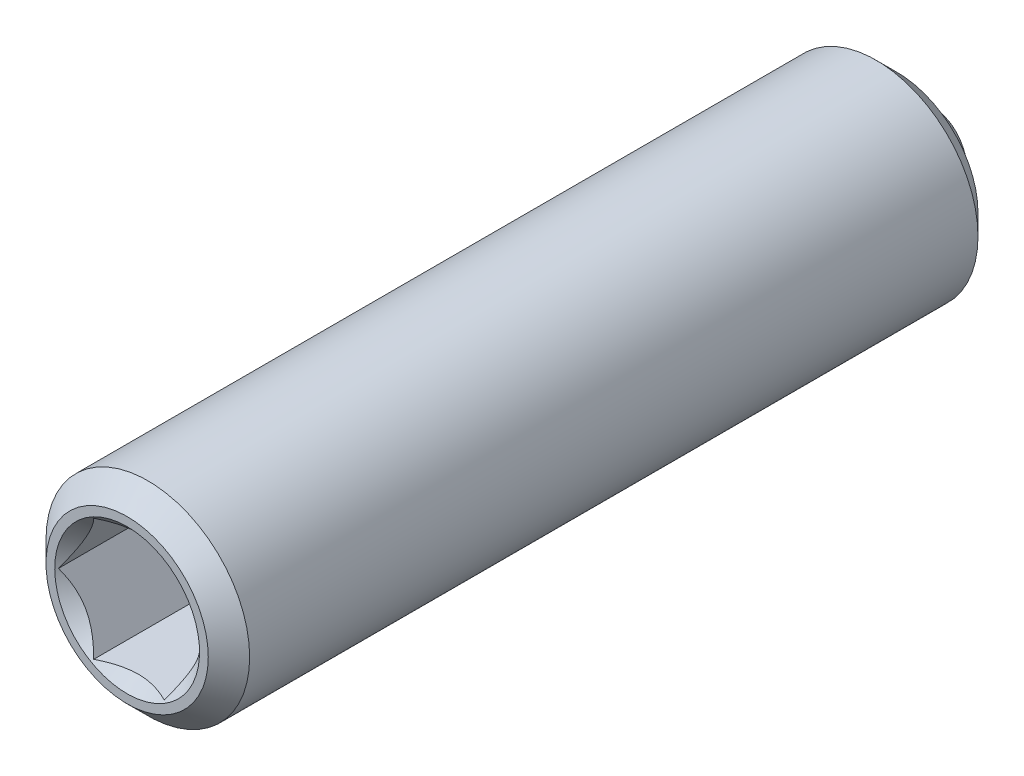
ISO-10303-21;
HEADER;
FILE_DESCRIPTION(('STEP AP214'),'2;1');
FILE_NAME('part.step','',(''),(''),'','','');
FILE_SCHEMA(('AUTOMOTIVE_DESIGN { 1 0 10303 214 1 1 1 1 }'));
ENDSEC;
DATA;
#1=APPLICATION_CONTEXT('core data for automotive mechanical design processes');
#2=APPLICATION_PROTOCOL_DEFINITION('international standard','automotive_design',2000,#1);
#3=PRODUCT_CONTEXT('',#1,'mechanical');
#4=PRODUCT('Part','Part','',(#3));
#5=PRODUCT_RELATED_PRODUCT_CATEGORY('part','',(#4));
#6=PRODUCT_DEFINITION_FORMATION('','',#4);
#7=PRODUCT_DEFINITION_CONTEXT('part definition',#1,'design');
#8=PRODUCT_DEFINITION('design','',#6,#7);
#9=PRODUCT_DEFINITION_SHAPE('','',#8);
#10=(LENGTH_UNIT() NAMED_UNIT(*) SI_UNIT(.MILLI.,.METRE.));
#11=(NAMED_UNIT(*) PLANE_ANGLE_UNIT() SI_UNIT($,.RADIAN.));
#12=(NAMED_UNIT(*) SI_UNIT($,.STERADIAN.) SOLID_ANGLE_UNIT());
#13=UNCERTAINTY_MEASURE_WITH_UNIT(LENGTH_MEASURE(1.E-05),#10,'distance_accuracy_value','');
#14=(GEOMETRIC_REPRESENTATION_CONTEXT(3) GLOBAL_UNCERTAINTY_ASSIGNED_CONTEXT((#13)) GLOBAL_UNIT_ASSIGNED_CONTEXT((#10,
#11,#12)) REPRESENTATION_CONTEXT('',''));
#15=CARTESIAN_POINT('',(0.,0.,0.));
#16=DIRECTION('',(0.,0.,1.));
#17=DIRECTION('',(1.,0.,0.));
#18=AXIS2_PLACEMENT_3D('',#15,#16,#17);
#19=CARTESIAN_POINT('',(-33.1630007981403,28.7089673374794,2.71961483447506));
#20=DIRECTION('',(0.,0.,-1.));
#21=DIRECTION('',(-1.,0.,0.));
#22=AXIS2_PLACEMENT_3D('',#19,#20,#21);
#23=PLANE('',#22);
#24=CARTESIAN_POINT('',(-33.1630007981403,28.7089673374794,2.71961483447507));
#25=DIRECTION('',(0.,0.,-1.));
#26=DIRECTION('',(0.,1.,0.));
#27=AXIS2_PLACEMENT_3D('',#24,#25,#26);
#28=CIRCLE('',#27,0.889);
#29=CARTESIAN_POINT('',(-33.1630007981403,29.5979673374794,2.71961483447507));
#30=VERTEX_POINT('',#29);
#31=EDGE_CURVE('P0_E164',#30,#30,#28,.T.);
#32=ORIENTED_EDGE('',*,*,#31,.T.);
#33=EDGE_LOOP('',(#32));
#34=FACE_BOUND('',#33,.T.);
#35=CARTESIAN_POINT('',(-33.1630007981403,28.7089673374794,2.71961483447507));
#36=DIRECTION('',(0.,0.,1.));
#37=DIRECTION('',(1.,0.,0.));
#38=AXIS2_PLACEMENT_3D('',#35,#36,#37);
#39=CIRCLE('',#38,0.996);
#40=CARTESIAN_POINT('',(-32.1670007981403,28.7089673374794,2.71961483447507));
#41=VERTEX_POINT('',#40);
#42=EDGE_CURVE('P0_E29',#41,#41,#39,.T.);
#43=ORIENTED_EDGE('',*,*,#42,.T.);
#44=EDGE_LOOP('',(#43));
#45=FACE_BOUND('',#44,.T.);
#46=ADVANCED_FACE('P0_F17',(#34,#45),#23,.F.);
#47=CARTESIAN_POINT('',(-33.1630007981403,28.7089673374794,2.46561483447506));
#48=DIRECTION('',(0.,0.,-1.));
#49=DIRECTION('',(-1.,0.,0.));
#50=AXIS2_PLACEMENT_3D('',#47,#48,#49);
#51=CONICAL_SURFACE('',#50,1.25,0.78539816339744);
#52=ORIENTED_EDGE('',*,*,#42,.F.);
#53=EDGE_LOOP('',(#52));
#54=FACE_BOUND('',#53,.T.);
#55=CARTESIAN_POINT('',(-33.1630007981403,28.7089673374794,2.46561483447506));
#56=DIRECTION('',(0.,0.,1.));
#57=DIRECTION('',(1.,0.,0.));
#58=AXIS2_PLACEMENT_3D('',#55,#56,#57);
#59=CIRCLE('',#58,1.25);
#60=CARTESIAN_POINT('',(-31.9130007981403,28.7089673374794,2.46561483447506));
#61=VERTEX_POINT('',#60);
#62=EDGE_CURVE('P0_E113',#61,#61,#59,.T.);
#63=ORIENTED_EDGE('',*,*,#62,.T.);
#64=EDGE_LOOP('',(#63));
#65=FACE_BOUND('',#64,.T.);
#66=ADVANCED_FACE('P0_F119',(#54,#65),#51,.T.);
#67=CARTESIAN_POINT('',(-33.1630007981403,28.7089673374794,57.6778825031788));
#68=DIRECTION('',(0.,0.,1.));
#69=DIRECTION('',(1.,0.,0.));
#70=AXIS2_PLACEMENT_3D('',#67,#68,#69);
#71=CYLINDRICAL_SURFACE('',#70,1.25);
#72=ORIENTED_EDGE('',*,*,#62,.F.);
#73=EDGE_LOOP('',(#72));
#74=FACE_BOUND('',#73,.T.);
#75=CARTESIAN_POINT('',(-33.1630007981403,28.7089673374794,-6.47518516552494));
#76=DIRECTION('',(0.,0.,1.));
#77=DIRECTION('',(1.,0.,0.));
#78=AXIS2_PLACEMENT_3D('',#75,#76,#77);
#79=CIRCLE('',#78,1.25);
#80=CARTESIAN_POINT('',(-31.9130007981403,28.7089673374794,-6.47518516552494));
#81=VERTEX_POINT('',#80);
#82=EDGE_CURVE('P0_E110',#81,#81,#79,.T.);
#83=ORIENTED_EDGE('',*,*,#82,.T.);
#84=EDGE_LOOP('',(#83));
#85=FACE_BOUND('',#84,.T.);
#86=ADVANCED_FACE('P0_F122',(#74,#85),#71,.T.);
#87=CARTESIAN_POINT('',(-33.1630007981403,28.7089673374794,-6.72918516552494));
#88=DIRECTION('',(0.,0.,1.));
#89=DIRECTION('',(1.,0.,0.));
#90=AXIS2_PLACEMENT_3D('',#87,#88,#89);
#91=CONICAL_SURFACE('',#90,0.996,0.78539816339744);
#92=ORIENTED_EDGE('',*,*,#82,.F.);
#93=EDGE_LOOP('',(#92));
#94=FACE_BOUND('',#93,.T.);
#95=CARTESIAN_POINT('',(-33.1630007981403,28.7089673374794,-6.72918516552494));
#96=DIRECTION('',(0.,0.,1.));
#97=DIRECTION('',(1.,0.,0.));
#98=AXIS2_PLACEMENT_3D('',#95,#96,#97);
#99=CIRCLE('',#98,0.996);
#100=CARTESIAN_POINT('',(-32.1670007981403,28.7089673374794,-6.72918516552494));
#101=VERTEX_POINT('',#100);
#102=EDGE_CURVE('P0_E107',#101,#101,#99,.T.);
#103=ORIENTED_EDGE('',*,*,#102,.T.);
#104=EDGE_LOOP('',(#103));
#105=FACE_BOUND('',#104,.T.);
#106=ADVANCED_FACE('P0_F127',(#94,#105),#91,.T.);
#107=CARTESIAN_POINT('',(-33.1630007981403,29.7049673374794,-6.72918516552494));
#108=DIRECTION('',(0.,0.,1.));
#109=DIRECTION('',(1.,0.,0.));
#110=AXIS2_PLACEMENT_3D('',#107,#108,#109);
#111=PLANE('',#110);
#112=ORIENTED_EDGE('',*,*,#102,.F.);
#113=EDGE_LOOP('',(#112));
#114=FACE_BOUND('',#113,.T.);
#115=CARTESIAN_POINT('',(-33.1630007981403,28.7089673374794,-6.72918516552494));
#116=DIRECTION('',(0.,0.,1.));
#117=DIRECTION('',(1.,0.,0.));
#118=AXIS2_PLACEMENT_3D('',#115,#116,#117);
#119=CIRCLE('',#118,0.75);
#120=CARTESIAN_POINT('',(-32.4130007981403,28.7089673374794,-6.72918516552494));
#121=VERTEX_POINT('',#120);
#122=EDGE_CURVE('P0_E104',#121,#121,#119,.T.);
#123=ORIENTED_EDGE('',*,*,#122,.T.);
#124=EDGE_LOOP('',(#123));
#125=FACE_BOUND('',#124,.T.);
#126=ADVANCED_FACE('P0_F133',(#114,#125),#111,.F.);
#127=CARTESIAN_POINT('',(-33.1630007981403,28.7089673374794,57.6778825031788));
#128=DIRECTION('',(0.,0.,1.));
#129=DIRECTION('',(1.,0.,0.));
#130=AXIS2_PLACEMENT_3D('',#127,#128,#129);
#131=CYLINDRICAL_SURFACE('',#130,0.75);
#132=ORIENTED_EDGE('',*,*,#122,.F.);
#133=EDGE_LOOP('',(#132));
#134=FACE_BOUND('',#133,.T.);
#135=CARTESIAN_POINT('',(-33.1630007981403,28.7089673374794,-6.22732499374512));
#136=DIRECTION('',(0.,0.,1.));
#137=DIRECTION('',(1.,0.,0.));
#138=AXIS2_PLACEMENT_3D('',#135,#136,#137);
#139=CIRCLE('',#138,0.75);
#140=CARTESIAN_POINT('',(-32.4130007981403,28.7089673374794,-6.22732499374512));
#141=VERTEX_POINT('',#140);
#142=EDGE_CURVE('P0_E101',#141,#141,#139,.T.);
#143=ORIENTED_EDGE('',*,*,#142,.T.);
#144=EDGE_LOOP('',(#143));
#145=FACE_BOUND('',#144,.T.);
#146=ADVANCED_FACE('P0_F139',(#134,#145),#131,.F.);
#147=CARTESIAN_POINT('',(-33.1630007981403,28.7089673374794,-5.47732499374511));
#148=DIRECTION('',(0.,0.,-1.));
#149=DIRECTION('',(-1.,0.,0.));
#150=AXIS2_PLACEMENT_3D('',#147,#148,#149);
#151=CONICAL_SURFACE('',#150,0.,0.785398163397435);
#152=ORIENTED_EDGE('',*,*,#142,.F.);
#153=EDGE_LOOP('',(#152));
#154=FACE_BOUND('',#153,.T.);
#155=CARTESIAN_POINT('',(-33.1630007981403,28.7089673374794,-5.47732499374511));
#156=VERTEX_POINT('',#155);
#157=VERTEX_LOOP('',#156);
#158=FACE_BOUND('',#157,.T.);
#159=ADVANCED_FACE('P0_F145',(#154,#158),#151,.F.);
#160=CARTESIAN_POINT('',(-33.1630007981403,28.7089673374794,1.83061483447508));
#161=DIRECTION('',(0.,0.,1.));
#162=DIRECTION('',(0.,-1.,0.));
#163=AXIS2_PLACEMENT_3D('',#160,#161,#162);
#164=CONICAL_SURFACE('',#163,0.,0.785398163397453);
#165=ORIENTED_EDGE('',*,*,#31,.F.);
#166=EDGE_LOOP('',(#165));
#167=FACE_BOUND('',#166,.T.);
#168=CARTESIAN_POINT('',(-34.0425134321986,27.9589673374794,2.98648786966026));
#169=CARTESIAN_POINT('',(-34.0211681100344,27.9589673374794,2.97024847947383));
#170=CARTESIAN_POINT('',(-33.9997055705422,27.9589673374794,2.95416358783385));
#171=CARTESIAN_POINT('',(-33.9564979950275,27.9589673374794,2.92236706739637));
#172=CARTESIAN_POINT('',(-33.9347528915436,27.9589673374794,2.90665553036631));
#173=CARTESIAN_POINT('',(-33.8687032144859,27.9589673374794,2.85995296646633));
#174=CARTESIAN_POINT('',(-33.8239085172943,27.9589673374794,2.82964382432147));
#175=CARTESIAN_POINT('',(-33.7298709247186,27.9589673374794,2.76999584174304));
#176=CARTESIAN_POINT('',(-33.6805219918868,27.9589673374794,2.74082227384625));
#177=CARTESIAN_POINT('',(-33.579342395383,27.9589673374794,2.68735382695284));
#178=CARTESIAN_POINT('',(-33.5275208693121,27.9589673374794,2.6630424831866));
#179=CARTESIAN_POINT('',(-33.4498788861714,27.9589673374794,2.63329806815176));
#180=CARTESIAN_POINT('',(-33.4252462031009,27.9589673374794,2.62478894634062));
#181=CARTESIAN_POINT('',(-33.3753858857222,27.9589673374794,2.60974110821306));
#182=CARTESIAN_POINT('',(-33.3501582118539,27.9589673374794,2.60320252331568));
#183=CARTESIAN_POINT('',(-33.2746553170791,27.9589673374794,2.58732205991524));
#184=CARTESIAN_POINT('',(-33.2235971883066,27.9589673374794,2.58132036145107));
#185=CARTESIAN_POINT('',(-33.1233397305914,27.9589673374794,2.58005407881637));
#186=CARTESIAN_POINT('',(-33.0741456969587,27.9589673374794,2.58437925251151));
#187=CARTESIAN_POINT('',(-33.0012050800911,27.9589673374794,2.59747755969887));
#188=CARTESIAN_POINT('',(-32.9768127738479,27.9589673374794,2.60302812797235));
#189=CARTESIAN_POINT('',(-32.9285520824627,27.9589673374794,2.61606394378376));
#190=CARTESIAN_POINT('',(-32.9046836591211,27.9589673374794,2.62354904975034));
#191=CARTESIAN_POINT('',(-32.8302496642989,27.9589673374794,2.64972907949656));
#192=CARTESIAN_POINT('',(-32.7807289039953,27.9589673374794,2.67137769298002));
#193=CARTESIAN_POINT('',(-32.6840052994642,27.9589673374794,2.71952867272661));
#194=CARTESIAN_POINT('',(-32.6368115002835,27.9589673374794,2.74604833509716));
#195=CARTESIAN_POINT('',(-32.546608344391,27.9589673374794,2.80078182509846));
#196=CARTESIAN_POINT('',(-32.5035074965681,27.9589673374794,2.82884679240507));
#197=CARTESIAN_POINT('',(-32.4400071849266,27.9589673374794,2.87224121680965));
#198=CARTESIAN_POINT('',(-32.4191140713775,27.9589673374794,2.88686076309093));
#199=CARTESIAN_POINT('',(-32.3776138434408,27.9589673374794,2.91648888193887));
#200=CARTESIAN_POINT('',(-32.3570066523079,27.9589673374794,2.93149734688724));
#201=CARTESIAN_POINT('',(-32.3365186272487,27.9589673374794,2.94666715350033));
#202=B_SPLINE_CURVE_WITH_KNOTS('',3,(#168,#169,#170,#171,#172,#173,#174,#175,#176,#177,#178,
#179,#180,#181,#182,#183,#184,#185,#186,#187,#188,#189,#190,#191,#192,#193,#194,#195,#196,#197,
#198,#199,#200,#201),.UNSPECIFIED.,.F.,.F.,(4,2,2,2,2,2,2,2,2,2,2,2,2,2,2,2,4),(0.,
0.0804596117681797,0.160938799452031,0.323124453194973,0.494968571191821,0.666220542229084,
0.744331171665934,0.82244700930421,0.9755971520518,1.12276514368748,1.1977430644728,
1.27271549985279,1.4343836465341,1.59663734906445,1.75085876684993,1.82735598888856,
1.90383226465775),.UNSPECIFIED.);
#203=CARTESIAN_POINT('',(-33.5960135000325,27.9589673374794,2.6966402382595));
#204=VERTEX_POINT('',#203);
#205=CARTESIAN_POINT('',(-32.7299880962481,27.9589673374794,2.6966402382595));
#206=VERTEX_POINT('',#205);
#207=EDGE_CURVE('P0_E85',#204,#206,#202,.T.);
#208=ORIENTED_EDGE('',*,*,#207,.F.);
#209=CARTESIAN_POINT('',(-34.0291416719786,28.7091673374794,2.69675573140428));
#210=CARTESIAN_POINT('',(-34.0142518301535,28.6833773749217,2.68187434872343));
#211=CARTESIAN_POINT('',(-33.9991129904287,28.6571561353507,2.66786650386646));
#212=CARTESIAN_POINT('',(-33.9682429340346,28.6036876292437,2.64221776294176));
#213=CARTESIAN_POINT('',(-33.9525087771001,28.5764352700188,2.63059114996517));
#214=CARTESIAN_POINT('',(-33.9207814844129,28.5214819870981,2.61067428403175));
#215=CARTESIAN_POINT('',(-33.9047964415994,28.4937950807839,2.60233393234087));
#216=CARTESIAN_POINT('',(-33.8724744460836,28.4378117423485,2.58948298022093));
#217=CARTESIAN_POINT('',(-33.8561384820408,28.4095170226358,2.58496277884834));
#218=CARTESIAN_POINT('',(-33.8279868976807,28.3607570482106,2.58088607135694));
#219=CARTESIAN_POINT('',(-33.8162079265919,28.3403552718238,2.58028303487358));
#220=CARTESIAN_POINT('',(-33.792672780358,28.299591202783,2.58129474427503));
#221=CARTESIAN_POINT('',(-33.7809166108125,28.279228919828,2.58290997924954));
#222=CARTESIAN_POINT('',(-33.7458159514267,28.2184327943926,2.59097638523254));
#223=CARTESIAN_POINT('',(-33.722646127693,28.1783014824833,2.60064917408723));
#224=CARTESIAN_POINT('',(-33.6819749504676,28.1078569371254,2.62399655623182));
#225=CARTESIAN_POINT('',(-33.6642831070638,28.0772137654703,2.63644879633176));
#226=CARTESIAN_POINT('',(-33.6295925693883,28.0171279916746,2.66449984849036));
#227=CARTESIAN_POINT('',(-33.612591831045,27.9876818490978,2.68008842416325));
#228=CARTESIAN_POINT('',(-33.5958980299787,27.9587673374794,2.69675573140427));
#229=B_SPLINE_CURVE_WITH_KNOTS('',3,(#209,#210,#211,#212,#213,#214,#215,#216,#217,#218,#219,
#220,#221,#222,#223,#224,#225,#226,#227,#228),.UNSPECIFIED.,.F.,.F.,(4,2,2,2,2,2,2,2,2,4),(0.,
0.0999419466095628,0.200466857654447,0.299393763705727,0.39807129730023,0.468665775681749,
0.539275821398843,0.680536257244571,0.792918418368075,0.904939568716029),.UNSPECIFIED.);
#230=CARTESIAN_POINT('',(-34.0290262019247,28.7089673374794,2.69664023825951));
#231=VERTEX_POINT('',#230);
#232=EDGE_CURVE('P0_E227',#231,#204,#229,.T.);
#233=ORIENTED_EDGE('',*,*,#232,.F.);
#234=CARTESIAN_POINT('',(-33.5958980299787,29.4591673374794,2.69675573140428));
#235=CARTESIAN_POINT('',(-33.6107878718037,29.4333773749217,2.68187434872343));
#236=CARTESIAN_POINT('',(-33.6259267115285,29.4071561353507,2.66786650386646));
#237=CARTESIAN_POINT('',(-33.6567967679226,29.3536876292437,2.64221776294177));
#238=CARTESIAN_POINT('',(-33.6725309248571,29.3264352700188,2.63059114996517));
#239=CARTESIAN_POINT('',(-33.7042582175443,29.2714819870981,2.61067428403175));
#240=CARTESIAN_POINT('',(-33.7202432603578,29.2437950807839,2.60233393234088));
#241=CARTESIAN_POINT('',(-33.7525652558736,29.1878117423486,2.58948298022093));
#242=CARTESIAN_POINT('',(-33.7689012199164,29.1595170226358,2.58496277884834));
#243=CARTESIAN_POINT('',(-33.7970528042765,29.1107570482106,2.58088607135694));
#244=CARTESIAN_POINT('',(-33.8088317753653,29.0903552718238,2.58028303487359));
#245=CARTESIAN_POINT('',(-33.8323669215993,29.049591202783,2.58129474427504));
#246=CARTESIAN_POINT('',(-33.8441230911447,29.029228919828,2.58290997924954));
#247=CARTESIAN_POINT('',(-33.8792237505305,28.9684327943926,2.59097638523255));
#248=CARTESIAN_POINT('',(-33.9023935742642,28.9283014824833,2.60064917408723));
#249=CARTESIAN_POINT('',(-33.9430647514896,28.8578569371254,2.62399655623182));
#250=CARTESIAN_POINT('',(-33.9607565948934,28.8272137654703,2.63644879633176));
#251=CARTESIAN_POINT('',(-33.9954471325689,28.7671279916746,2.66449984849037));
#252=CARTESIAN_POINT('',(-34.0124478709122,28.7376818490978,2.68008842416326));
#253=CARTESIAN_POINT('',(-34.0291416719786,28.7087673374794,2.69675573140428));
#254=B_SPLINE_CURVE_WITH_KNOTS('',3,(#234,#235,#236,#237,#238,#239,#240,#241,#242,#243,#244,
#245,#246,#247,#248,#249,#250,#251,#252,#253),.UNSPECIFIED.,.F.,.F.,(4,2,2,2,2,2,2,2,2,4),(0.,
0.0999419466095609,0.200466857654445,0.299393763705716,0.398071297300229,0.46866577568175,
0.539275821398838,0.680536257244568,0.792918418368071,0.904939568716027),.UNSPECIFIED.);
#255=CARTESIAN_POINT('',(-33.5960135000325,29.4589673374794,2.69664023825951));
#256=VERTEX_POINT('',#255);
#257=EDGE_CURVE('P0_E166',#256,#231,#254,.T.);
#258=ORIENTED_EDGE('',*,*,#257,.F.);
#259=CARTESIAN_POINT('',(-34.0425134322245,29.4589673374794,2.98648786967997));
#260=CARTESIAN_POINT('',(-34.0211681100595,29.4589673374794,2.97024847949278));
#261=CARTESIAN_POINT('',(-33.9997055705666,29.4589673374794,2.95416358785204));
#262=CARTESIAN_POINT('',(-33.9564979950504,29.4589673374794,2.92236706741305));
#263=CARTESIAN_POINT('',(-33.9347528915658,29.4589673374794,2.90665553038223));
#264=CARTESIAN_POINT('',(-33.8687032145059,29.4589673374794,2.85995296647997));
#265=CARTESIAN_POINT('',(-33.8239085173127,29.4589673374794,2.8296438243336));
#266=CARTESIAN_POINT('',(-33.7298709247336,29.4589673374794,2.76999584175205));
#267=CARTESIAN_POINT('',(-33.6805219919,29.4589673374794,2.74082227385366));
#268=CARTESIAN_POINT('',(-33.5793423953923,29.4589673374794,2.6873538269573));
#269=CARTESIAN_POINT('',(-33.5275208693195,29.4589673374794,2.66304248318969));
#270=CARTESIAN_POINT('',(-33.4498788861772,29.4589673374794,2.63329806815386));
#271=CARTESIAN_POINT('',(-33.4252462031073,29.4589673374794,2.62478894634277));
#272=CARTESIAN_POINT('',(-33.3753858857299,29.4589673374794,2.60974110821519));
#273=CARTESIAN_POINT('',(-33.3501582118623,29.4589673374794,2.60320252331774));
#274=CARTESIAN_POINT('',(-33.2746553170894,29.4589673374794,2.58732205991685));
#275=CARTESIAN_POINT('',(-33.2235971883182,29.4589673374794,2.58132036145209));
#276=CARTESIAN_POINT('',(-33.1233397306052,29.4589673374794,2.58005407881571));
#277=CARTESIAN_POINT('',(-33.0741456969734,29.4589673374794,2.58437925250982));
#278=CARTESIAN_POINT('',(-33.0012050801071,29.4589673374794,2.59747755969551));
#279=CARTESIAN_POINT('',(-32.9768127738643,29.4589673374794,2.6030281279684));
#280=CARTESIAN_POINT('',(-32.9285520824799,29.4589673374794,2.61606394377863));
#281=CARTESIAN_POINT('',(-32.9046836591387,29.4589673374794,2.6235490497446));
#282=CARTESIAN_POINT('',(-32.8302496643203,29.4589673374794,2.64972907948803));
#283=CARTESIAN_POINT('',(-32.78072890402,29.4589673374794,2.67137769296892));
#284=CARTESIAN_POINT('',(-32.684005299495,29.4589673374794,2.71952867271008));
#285=CARTESIAN_POINT('',(-32.6368115003173,29.4589673374794,2.74604833507777));
#286=CARTESIAN_POINT('',(-32.5466083444301,29.4589673374794,2.8007818250736));
#287=CARTESIAN_POINT('',(-32.5035074966097,29.4589673374794,2.82884679237764));
#288=CARTESIAN_POINT('',(-32.4400071849717,29.4589673374794,2.87224121677834));
#289=CARTESIAN_POINT('',(-32.4191140714238,29.4589673374794,2.88686076305835));
#290=CARTESIAN_POINT('',(-32.3776138434894,29.4589673374794,2.91648888190373));
#291=CARTESIAN_POINT('',(-32.3570066523577,29.4589673374794,2.93149734685083));
#292=CARTESIAN_POINT('',(-32.3365186272996,29.4589673374794,2.94666715346264));
#293=B_SPLINE_CURVE_WITH_KNOTS('',3,(#259,#260,#261,#262,#263,#264,#265,#266,#267,#268,#269,
#270,#271,#272,#273,#274,#275,#276,#277,#278,#279,#280,#281,#282,#283,#284,#285,#286,#287,#288,
#289,#290,#291,#292),.UNSPECIFIED.,.F.,.F.,(4,2,2,2,2,2,2,2,2,2,2,2,2,2,2,2,4),(0.,
0.0804596117713139,0.160938799458302,0.323124453207642,0.494968571211666,0.666220542256047,
0.744331171691057,0.822447009327489,0.975597152071558,1.12276514370424,1.19774306448795,
1.2727154998663,1.43438364653571,1.59663734905406,1.75085876682929,1.82735598886286,
1.90383226462701),.UNSPECIFIED.);
#294=CARTESIAN_POINT('',(-32.7299880962481,29.4589673374794,2.69664023825951));
#295=VERTEX_POINT('',#294);
#296=EDGE_CURVE('P0_E36',#295,#256,#293,.F.);
#297=ORIENTED_EDGE('',*,*,#296,.F.);
#298=CARTESIAN_POINT('',(-32.296859924302,28.7087673374794,2.69675573140428));
#299=CARTESIAN_POINT('',(-32.3117497661271,28.7345573000371,2.68187434872343));
#300=CARTESIAN_POINT('',(-32.3268886058519,28.7607785396081,2.66786650386646));
#301=CARTESIAN_POINT('',(-32.3577586622459,28.8142470457151,2.64221776294176));
#302=CARTESIAN_POINT('',(-32.3734928191805,28.84149940494,2.63059114996517));
#303=CARTESIAN_POINT('',(-32.4052201118676,28.8964526878608,2.61067428403175));
#304=CARTESIAN_POINT('',(-32.4212051546811,28.9241395941749,2.60233393234087));
#305=CARTESIAN_POINT('',(-32.4535271501969,28.9801229326103,2.58948298022093));
#306=CARTESIAN_POINT('',(-32.4698631142397,29.0084176523231,2.58496277884834));
#307=CARTESIAN_POINT('',(-32.4980146985998,29.0571776267483,2.58088607135694));
#308=CARTESIAN_POINT('',(-32.5097936696886,29.077579403135,2.58028303487358));
#309=CARTESIAN_POINT('',(-32.5333288159226,29.1183434721758,2.58129474427503));
#310=CARTESIAN_POINT('',(-32.545084985468,29.1387057551309,2.58290997924954));
#311=CARTESIAN_POINT('',(-32.5801856448538,29.1995018805662,2.59097638523254));
#312=CARTESIAN_POINT('',(-32.6033554685876,29.2396331924755,2.60064917408723));
#313=CARTESIAN_POINT('',(-32.6440266458129,29.3100777378334,2.62399655623182));
#314=CARTESIAN_POINT('',(-32.6617184892168,29.3407209094885,2.63644879633176));
#315=CARTESIAN_POINT('',(-32.6964090268922,29.4008066832842,2.66449984849036));
#316=CARTESIAN_POINT('',(-32.7134097652355,29.430252825861,2.68008842416325));
#317=CARTESIAN_POINT('',(-32.7301035663019,29.4591673374794,2.69675573140428));
#318=B_SPLINE_CURVE_WITH_KNOTS('',3,(#298,#299,#300,#301,#302,#303,#304,#305,#306,#307,#308,
#309,#310,#311,#312,#313,#314,#315,#316,#317),.UNSPECIFIED.,.F.,.F.,(4,2,2,2,2,2,2,2,2,4),(0.,
0.0999419466095626,0.200466857654447,0.299393763705715,0.39807129730023,0.468665775681749,
0.539275821398842,0.680536257244567,0.792918418368072,0.904939568716029),.UNSPECIFIED.);
#319=CARTESIAN_POINT('',(-32.2969753943558,28.7089673374794,2.69664023825951));
#320=VERTEX_POINT('',#319);
#321=EDGE_CURVE('P0_E11',#320,#295,#318,.T.);
#322=ORIENTED_EDGE('',*,*,#321,.F.);
#323=CARTESIAN_POINT('',(-32.7301035663019,27.9587673374794,2.69675573140427));
#324=CARTESIAN_POINT('',(-32.7152137244768,27.9845573000371,2.68187434872343));
#325=CARTESIAN_POINT('',(-32.700074884752,28.0107785396081,2.66786650386646));
#326=CARTESIAN_POINT('',(-32.669204828358,28.0642470457151,2.64221776294176));
#327=CARTESIAN_POINT('',(-32.6534706714234,28.09149940494,2.63059114996517));
#328=CARTESIAN_POINT('',(-32.6217433787363,28.1464526878608,2.61067428403175));
#329=CARTESIAN_POINT('',(-32.6057583359228,28.1741395941749,2.60233393234088));
#330=CARTESIAN_POINT('',(-32.573436340407,28.2301229326103,2.58948298022093));
#331=CARTESIAN_POINT('',(-32.5571003763642,28.2584176523231,2.58496277884834));
#332=CARTESIAN_POINT('',(-32.5289487920041,28.3071776267483,2.58088607135694));
#333=CARTESIAN_POINT('',(-32.5171698209153,28.327579403135,2.58028303487359));
#334=CARTESIAN_POINT('',(-32.4936346746813,28.3683434721758,2.58129474427503));
#335=CARTESIAN_POINT('',(-32.4818785051359,28.3887057551309,2.58290997924954));
#336=CARTESIAN_POINT('',(-32.4467778457501,28.4495018805662,2.59097638523255));
#337=CARTESIAN_POINT('',(-32.4236080220163,28.4896331924755,2.60064917408723));
#338=CARTESIAN_POINT('',(-32.382936844791,28.5600777378334,2.62399655623182));
#339=CARTESIAN_POINT('',(-32.3652450013871,28.5907209094885,2.63644879633176));
#340=CARTESIAN_POINT('',(-32.3305544637117,28.6508066832842,2.66449984849037));
#341=CARTESIAN_POINT('',(-32.3135537253684,28.680252825861,2.68008842416326));
#342=CARTESIAN_POINT('',(-32.296859924302,28.7091673374794,2.69675573140427));
#343=B_SPLINE_CURVE_WITH_KNOTS('',3,(#323,#324,#325,#326,#327,#328,#329,#330,#331,#332,#333,
#334,#335,#336,#337,#338,#339,#340,#341,#342),.UNSPECIFIED.,.F.,.F.,(4,2,2,2,2,2,2,2,2,4),(0.,
0.0999419466095608,0.200466857654445,0.299393763705715,0.398071297300228,0.46866577568175,
0.539275821398838,0.680536257244568,0.79291841836807,0.904939568716027),.UNSPECIFIED.);
#344=EDGE_CURVE('P0_E72',#206,#320,#343,.T.);
#345=ORIENTED_EDGE('',*,*,#344,.F.);
#346=EDGE_LOOP('',(#208,#233,#258,#297,#322,#345));
#347=FACE_BOUND('',#346,.T.);
#348=ADVANCED_FACE('P0_F71',(#167,#347),#164,.F.);
#349=CARTESIAN_POINT('',(-32.2969753943558,28.7089673374794,-0.328385165524937));
#350=DIRECTION('',(0.,0.,1.));
#351=DIRECTION('',(1.,0.,0.));
#352=AXIS2_PLACEMENT_3D('',#349,#350,#351);
#353=PLANE('',#352);
#354=DIRECTION('',(0.5,0.866025403784439,0.));
#355=VECTOR('',#354,1.);
#356=CARTESIAN_POINT('',(-32.7299880962481,27.9589673374794,-0.328385165524937));
#357=LINE('',#356,#355);
#358=CARTESIAN_POINT('',(-32.7299880962481,27.9589673374794,-0.328385165524937));
#359=VERTEX_POINT('',#358);
#360=CARTESIAN_POINT('',(-32.2969753943558,28.7089673374794,-0.328385165524937));
#361=VERTEX_POINT('',#360);
#362=EDGE_CURVE('P0_E84',#359,#361,#357,.T.);
#363=ORIENTED_EDGE('',*,*,#362,.T.);
#364=DIRECTION('',(-0.500000000000001,0.866025403784438,0.));
#365=VECTOR('',#364,1.);
#366=CARTESIAN_POINT('',(-32.2969753943558,28.7089673374794,-0.328385165524937));
#367=LINE('',#366,#365);
#368=CARTESIAN_POINT('',(-32.7299880962481,29.4589673374794,-0.328385165524937));
#369=VERTEX_POINT('',#368);
#370=EDGE_CURVE('P0_E89',#361,#369,#367,.T.);
#371=ORIENTED_EDGE('',*,*,#370,.T.);
#372=DIRECTION('',(-1.,0.,0.));
#373=VECTOR('',#372,1.);
#374=CARTESIAN_POINT('',(-32.7299880962481,29.4589673374794,-0.328385165524937));
#375=LINE('',#374,#373);
#376=CARTESIAN_POINT('',(-33.5960135000325,29.4589673374794,-0.328385165524937));
#377=VERTEX_POINT('',#376);
#378=EDGE_CURVE('P0_E203',#369,#377,#375,.T.);
#379=ORIENTED_EDGE('',*,*,#378,.T.);
#380=DIRECTION('',(-0.5,-0.866025403784439,0.));
#381=VECTOR('',#380,1.);
#382=CARTESIAN_POINT('',(-33.5960135000325,29.4589673374794,-0.328385165524937));
#383=LINE('',#382,#381);
#384=CARTESIAN_POINT('',(-34.0290262019247,28.7089673374794,-0.328385165524937));
#385=VERTEX_POINT('',#384);
#386=EDGE_CURVE('P0_E206',#377,#385,#383,.T.);
#387=ORIENTED_EDGE('',*,*,#386,.T.);
#388=DIRECTION('',(0.5,-0.866025403784438,0.));
#389=VECTOR('',#388,1.);
#390=CARTESIAN_POINT('',(-34.0290262019247,28.7089673374794,-0.328385165524937));
#391=LINE('',#390,#389);
#392=CARTESIAN_POINT('',(-33.5960135000325,27.9589673374794,-0.328385165524937));
#393=VERTEX_POINT('',#392);
#394=EDGE_CURVE('P0_E97',#385,#393,#391,.T.);
#395=ORIENTED_EDGE('',*,*,#394,.T.);
#396=DIRECTION('',(1.,0.,0.));
#397=VECTOR('',#396,1.);
#398=CARTESIAN_POINT('',(-33.5960135000325,27.9589673374794,-0.328385165524937));
#399=LINE('',#398,#397);
#400=EDGE_CURVE('P0_E92',#393,#359,#399,.T.);
#401=ORIENTED_EDGE('',*,*,#400,.T.);
#402=EDGE_LOOP('',(#363,#371,#379,#387,#395,#401));
#403=FACE_BOUND('',#402,.T.);
#404=ADVANCED_FACE('P0_F155',(#403),#353,.T.);
#405=CARTESIAN_POINT('',(-32.2969753943558,28.7089673374794,-0.328385165524937));
#406=DIRECTION('',(0.866025403784438,0.500000000000001,0.));
#407=DIRECTION('',(-0.500000000000001,0.866025403784438,0.));
#408=AXIS2_PLACEMENT_3D('',#405,#406,#407);
#409=PLANE('',#408);
#410=DIRECTION('',(0.,0.,1.));
#411=VECTOR('',#410,1.);
#412=CARTESIAN_POINT('',(-32.2969753943558,28.7089673374794,-0.328385165524937));
#413=LINE('',#412,#411);
#414=EDGE_CURVE('P0_E81',#361,#320,#413,.T.);
#415=ORIENTED_EDGE('',*,*,#414,.T.);
#416=ORIENTED_EDGE('',*,*,#321,.T.);
#417=DIRECTION('',(0.,0.,1.));
#418=VECTOR('',#417,1.);
#419=CARTESIAN_POINT('',(-32.7299880962481,29.4589673374794,-0.328385165524937));
#420=LINE('',#419,#418);
#421=EDGE_CURVE('P0_E91',#369,#295,#420,.T.);
#422=ORIENTED_EDGE('',*,*,#421,.F.);
#423=ORIENTED_EDGE('',*,*,#370,.F.);
#424=EDGE_LOOP('',(#415,#416,#422,#423));
#425=FACE_BOUND('',#424,.T.);
#426=ADVANCED_FACE('P0_F87',(#425),#409,.F.);
#427=CARTESIAN_POINT('',(-32.7299880962481,29.4589673374794,-0.328385165524937));
#428=DIRECTION('',(0.,1.,0.));
#429=DIRECTION('',(-1.,0.,0.));
#430=AXIS2_PLACEMENT_3D('',#427,#428,#429);
#431=PLANE('',#430);
#432=ORIENTED_EDGE('',*,*,#421,.T.);
#433=ORIENTED_EDGE('',*,*,#296,.T.);
#434=DIRECTION('',(0.,0.,1.));
#435=VECTOR('',#434,1.);
#436=CARTESIAN_POINT('',(-33.5960135000325,29.4589673374794,-0.328385165524937));
#437=LINE('',#436,#435);
#438=EDGE_CURVE('P0_E94',#377,#256,#437,.T.);
#439=ORIENTED_EDGE('',*,*,#438,.F.);
#440=ORIENTED_EDGE('',*,*,#378,.F.);
#441=EDGE_LOOP('',(#432,#433,#439,#440));
#442=FACE_BOUND('',#441,.T.);
#443=ADVANCED_FACE('P0_F180',(#442),#431,.F.);
#444=CARTESIAN_POINT('',(-33.5960135000325,29.4589673374794,-0.328385165524937));
#445=DIRECTION('',(-0.866025403784439,0.5,0.));
#446=DIRECTION('',(-0.5,-0.866025403784439,0.));
#447=AXIS2_PLACEMENT_3D('',#444,#445,#446);
#448=PLANE('',#447);
#449=ORIENTED_EDGE('',*,*,#438,.T.);
#450=ORIENTED_EDGE('',*,*,#257,.T.);
#451=DIRECTION('',(0.,0.,1.));
#452=VECTOR('',#451,1.);
#453=CARTESIAN_POINT('',(-34.0290262019247,28.7089673374794,-0.328385165524937));
#454=LINE('',#453,#452);
#455=EDGE_CURVE('P0_E215',#385,#231,#454,.T.);
#456=ORIENTED_EDGE('',*,*,#455,.F.);
#457=ORIENTED_EDGE('',*,*,#386,.F.);
#458=EDGE_LOOP('',(#449,#450,#456,#457));
#459=FACE_BOUND('',#458,.T.);
#460=ADVANCED_FACE('P0_F183',(#459),#448,.F.);
#461=CARTESIAN_POINT('',(-34.0290262019247,28.7089673374794,-0.328385165524937));
#462=DIRECTION('',(-0.866025403784438,-0.5,0.));
#463=DIRECTION('',(0.5,-0.866025403784438,0.));
#464=AXIS2_PLACEMENT_3D('',#461,#462,#463);
#465=PLANE('',#464);
#466=ORIENTED_EDGE('',*,*,#455,.T.);
#467=ORIENTED_EDGE('',*,*,#232,.T.);
#468=DIRECTION('',(0.,0.,1.));
#469=VECTOR('',#468,1.);
#470=CARTESIAN_POINT('',(-33.5960135000325,27.9589673374794,-0.328385165524937));
#471=LINE('',#470,#469);
#472=EDGE_CURVE('P0_E212',#393,#204,#471,.T.);
#473=ORIENTED_EDGE('',*,*,#472,.F.);
#474=ORIENTED_EDGE('',*,*,#394,.F.);
#475=EDGE_LOOP('',(#466,#467,#473,#474));
#476=FACE_BOUND('',#475,.T.);
#477=ADVANCED_FACE('P0_F232',(#476),#465,.F.);
#478=CARTESIAN_POINT('',(-33.5960135000325,27.9589673374794,-0.328385165524937));
#479=DIRECTION('',(0.,-1.,0.));
#480=DIRECTION('',(0.,0.,-1.));
#481=AXIS2_PLACEMENT_3D('',#478,#479,#480);
#482=PLANE('',#481);
#483=ORIENTED_EDGE('',*,*,#472,.T.);
#484=ORIENTED_EDGE('',*,*,#207,.T.);
#485=DIRECTION('',(0.,0.,1.));
#486=VECTOR('',#485,1.);
#487=CARTESIAN_POINT('',(-32.7299880962481,27.9589673374794,-0.328385165524937));
#488=LINE('',#487,#486);
#489=EDGE_CURVE('P0_E83',#359,#206,#488,.T.);
#490=ORIENTED_EDGE('',*,*,#489,.F.);
#491=ORIENTED_EDGE('',*,*,#400,.F.);
#492=EDGE_LOOP('',(#483,#484,#490,#491));
#493=FACE_BOUND('',#492,.T.);
#494=ADVANCED_FACE('P0_F191',(#493),#482,.F.);
#495=CARTESIAN_POINT('',(-32.7299880962481,27.9589673374794,-0.328385165524937));
#496=DIRECTION('',(0.866025403784439,-0.5,0.));
#497=DIRECTION('',(0.5,0.866025403784439,0.));
#498=AXIS2_PLACEMENT_3D('',#495,#496,#497);
#499=PLANE('',#498);
#500=ORIENTED_EDGE('',*,*,#489,.T.);
#501=ORIENTED_EDGE('',*,*,#344,.T.);
#502=ORIENTED_EDGE('',*,*,#414,.F.);
#503=ORIENTED_EDGE('',*,*,#362,.F.);
#504=EDGE_LOOP('',(#500,#501,#502,#503));
#505=FACE_BOUND('',#504,.T.);
#506=ADVANCED_FACE('P0_F79',(#505),#499,.F.);
#507=CLOSED_SHELL('',(#46,#66,#86,#106,#126,#146,#159,#348,#404,#426,#443,#460,#477,#494,#506));
#508=MANIFOLD_SOLID_BREP('P0_B1',#507);
#509=CARTESIAN_POINT('',(-33.1630007981403,28.7089673374794,-6.53798516552495));
#510=DIRECTION('',(0.,0.,-1.));
#511=DIRECTION('',(1.,0.,0.));
#512=AXIS2_PLACEMENT_3D('',#509,#510,#511);
#513=SPHERICAL_SURFACE('',#512,0.75);
#514=CARTESIAN_POINT('',(-33.1630007981403,28.7089673374794,-6.53798516552495));
#515=DIRECTION('',(0.,0.999999999999956,0.));
#516=DIRECTION('',(1.,0.,0.));
#517=AXIS2_PLACEMENT_3D('',#514,#515,#516);
#518=CIRCLE('',#517,0.75);
#519=CARTESIAN_POINT('',(-32.4130007981403,28.7089673374794,-6.53798516552495));
#520=VERTEX_POINT('',#519);
#521=CARTESIAN_POINT('',(-33.9130007981403,28.7089673374794,-6.53798516552495));
#522=VERTEX_POINT('',#521);
#523=EDGE_CURVE('P1_E33',#520,#522,#518,.T.);
#524=ORIENTED_EDGE('',*,*,#523,.T.);
#525=CARTESIAN_POINT('',(-33.1630007981403,28.7089673374794,-6.53798516552495));
#526=DIRECTION('',(0.,0.,-1.));
#527=DIRECTION('',(0.,0.999999999999956,0.));
#528=AXIS2_PLACEMENT_3D('',#525,#526,#527);
#529=CIRCLE('',#528,0.75);
#530=EDGE_CURVE('P1_E10',#522,#520,#529,.T.);
#531=ORIENTED_EDGE('',*,*,#530,.T.);
#532=EDGE_LOOP('',(#524,#531));
#533=FACE_BOUND('',#532,.T.);
#534=ADVANCED_FACE('P1_F16',(#533),#513,.T.);
#535=ORIENTED_EDGE('',*,*,#523,.F.);
#536=CARTESIAN_POINT('',(-33.1630007981403,28.7089673374794,-6.53798516552495));
#537=DIRECTION('',(0.,0.,-1.));
#538=DIRECTION('',(0.,0.999999999999956,0.));
#539=AXIS2_PLACEMENT_3D('',#536,#537,#538);
#540=CIRCLE('',#539,0.75);
#541=EDGE_CURVE('P1_E23',#520,#522,#540,.T.);
#542=ORIENTED_EDGE('',*,*,#541,.T.);
#543=EDGE_LOOP('',(#535,#542));
#544=FACE_BOUND('',#543,.T.);
#545=ADVANCED_FACE('P1_F40',(#544),#513,.T.);
#546=ORIENTED_EDGE('',*,*,#530,.F.);
#547=EDGE_CURVE('P1_E36',#522,#520,#518,.T.);
#548=ORIENTED_EDGE('',*,*,#547,.T.);
#549=EDGE_LOOP('',(#546,#548));
#550=FACE_BOUND('',#549,.T.);
#551=ADVANCED_FACE('P1_F38',(#550),#513,.T.);
#552=ORIENTED_EDGE('',*,*,#541,.F.);
#553=ORIENTED_EDGE('',*,*,#547,.F.);
#554=EDGE_LOOP('',(#552,#553));
#555=FACE_BOUND('',#554,.T.);
#556=ADVANCED_FACE('P1_F18',(#555),#513,.T.);
#557=CLOSED_SHELL('',(#534,#545,#551,#556));
#558=MANIFOLD_SOLID_BREP('P1_B1',#557);
#559=ADVANCED_BREP_SHAPE_REPRESENTATION('',(#18,#508,#558),#14);
#560=SHAPE_DEFINITION_REPRESENTATION(#9,#559);
ENDSEC;
END-ISO-10303-21;
